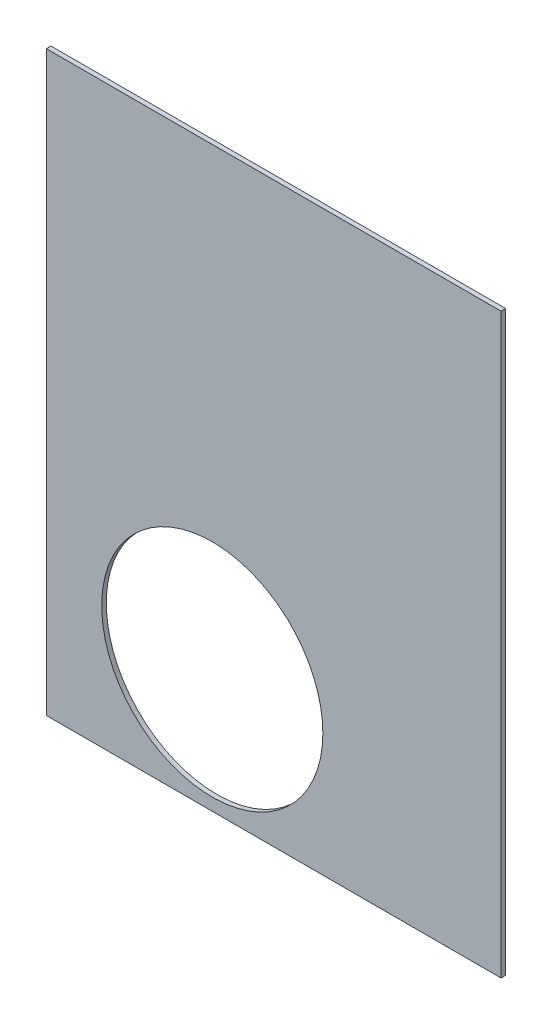
ISO-10303-21;
HEADER;
FILE_DESCRIPTION(('STEP AP214'),'2;1');
FILE_NAME('part.step','',(''),(''),'','','');
FILE_SCHEMA(('AUTOMOTIVE_DESIGN { 1 0 10303 214 1 1 1 1 }'));
ENDSEC;
DATA;
#1=APPLICATION_CONTEXT('core data for automotive mechanical design processes');
#2=APPLICATION_PROTOCOL_DEFINITION('international standard','automotive_design',2000,#1);
#3=PRODUCT_CONTEXT('',#1,'mechanical');
#4=PRODUCT('Part','Part','',(#3));
#5=PRODUCT_RELATED_PRODUCT_CATEGORY('part','',(#4));
#6=PRODUCT_DEFINITION_FORMATION('','',#4);
#7=PRODUCT_DEFINITION_CONTEXT('part definition',#1,'design');
#8=PRODUCT_DEFINITION('design','',#6,#7);
#9=PRODUCT_DEFINITION_SHAPE('','',#8);
#10=(LENGTH_UNIT() NAMED_UNIT(*) SI_UNIT(.MILLI.,.METRE.));
#11=(NAMED_UNIT(*) PLANE_ANGLE_UNIT() SI_UNIT($,.RADIAN.));
#12=(NAMED_UNIT(*) SI_UNIT($,.STERADIAN.) SOLID_ANGLE_UNIT());
#13=UNCERTAINTY_MEASURE_WITH_UNIT(LENGTH_MEASURE(1.E-05),#10,'distance_accuracy_value','');
#14=(GEOMETRIC_REPRESENTATION_CONTEXT(3) GLOBAL_UNCERTAINTY_ASSIGNED_CONTEXT((#13)) GLOBAL_UNIT_ASSIGNED_CONTEXT((#10,
#11,#12)) REPRESENTATION_CONTEXT('',''));
#15=CARTESIAN_POINT('',(0.,0.,0.));
#16=DIRECTION('',(0.,0.,1.));
#17=DIRECTION('',(1.,0.,0.));
#18=AXIS2_PLACEMENT_3D('',#15,#16,#17);
#19=CARTESIAN_POINT('',(36.9999999999999,5.50000000000002,0.75));
#20=DIRECTION('',(0.,1.,0.));
#21=DIRECTION('',(0.,0.,1.));
#22=AXIS2_PLACEMENT_3D('',#19,#20,#21);
#23=PLANE('',#22);
#24=DIRECTION('',(1.,0.,0.));
#25=VECTOR('',#24,1.);
#26=CARTESIAN_POINT('',(36.9999999999999,5.50000000000002,0.));
#27=LINE('',#26,#25);
#28=CARTESIAN_POINT('',(-37.,5.50000000000002,0.));
#29=VERTEX_POINT('',#28);
#30=CARTESIAN_POINT('',(36.9999999999999,5.50000000000002,0.));
#31=VERTEX_POINT('',#30);
#32=EDGE_CURVE('E96',#29,#31,#27,.T.);
#33=ORIENTED_EDGE('',*,*,#32,.T.);
#34=DIRECTION('',(0.,0.,-1.));
#35=VECTOR('',#34,1.);
#36=CARTESIAN_POINT('',(36.9999999999999,5.50000000000002,0.75));
#37=LINE('',#36,#35);
#38=CARTESIAN_POINT('',(36.9999999999999,5.50000000000002,0.75));
#39=VERTEX_POINT('',#38);
#40=EDGE_CURVE('E11',#39,#31,#37,.T.);
#41=ORIENTED_EDGE('',*,*,#40,.F.);
#42=DIRECTION('',(1.,0.,0.));
#43=VECTOR('',#42,1.);
#44=CARTESIAN_POINT('',(36.9999999999999,5.50000000000002,0.75));
#45=LINE('',#44,#43);
#46=CARTESIAN_POINT('',(-37.,5.50000000000002,0.75));
#47=VERTEX_POINT('',#46);
#48=EDGE_CURVE('E84',#47,#39,#45,.T.);
#49=ORIENTED_EDGE('',*,*,#48,.F.);
#50=DIRECTION('',(0.,0.,-1.));
#51=VECTOR('',#50,1.);
#52=CARTESIAN_POINT('',(-37.,5.50000000000002,0.75));
#53=LINE('',#52,#51);
#54=EDGE_CURVE('E92',#47,#29,#53,.T.);
#55=ORIENTED_EDGE('',*,*,#54,.T.);
#56=EDGE_LOOP('',(#33,#41,#49,#55));
#57=FACE_BOUND('',#56,.T.);
#58=ADVANCED_FACE('F33',(#57),#23,.F.);
#59=CARTESIAN_POINT('',(36.9999999999999,99.5,0.75));
#60=DIRECTION('',(-1.,0.,0.));
#61=DIRECTION('',(0.,0.,1.));
#62=AXIS2_PLACEMENT_3D('',#59,#60,#61);
#63=PLANE('',#62);
#64=DIRECTION('',(0.,1.,0.));
#65=VECTOR('',#64,1.);
#66=CARTESIAN_POINT('',(36.9999999999999,99.5,0.));
#67=LINE('',#66,#65);
#68=CARTESIAN_POINT('',(36.9999999999999,99.5,0.));
#69=VERTEX_POINT('',#68);
#70=EDGE_CURVE('E88',#31,#69,#67,.T.);
#71=ORIENTED_EDGE('',*,*,#70,.T.);
#72=DIRECTION('',(0.,0.,-1.));
#73=VECTOR('',#72,1.);
#74=CARTESIAN_POINT('',(36.9999999999999,99.5,0.75));
#75=LINE('',#74,#73);
#76=CARTESIAN_POINT('',(36.9999999999999,99.5,0.75));
#77=VERTEX_POINT('',#76);
#78=EDGE_CURVE('E41',#77,#69,#75,.T.);
#79=ORIENTED_EDGE('',*,*,#78,.F.);
#80=DIRECTION('',(0.,1.,0.));
#81=VECTOR('',#80,1.);
#82=CARTESIAN_POINT('',(36.9999999999999,99.5,0.75));
#83=LINE('',#82,#81);
#84=EDGE_CURVE('E79',#39,#77,#83,.T.);
#85=ORIENTED_EDGE('',*,*,#84,.F.);
#86=ORIENTED_EDGE('',*,*,#40,.T.);
#87=EDGE_LOOP('',(#71,#79,#85,#86));
#88=FACE_BOUND('',#87,.T.);
#89=ADVANCED_FACE('F87',(#88),#63,.F.);
#90=CARTESIAN_POINT('',(-37.,99.5,0.75));
#91=DIRECTION('',(0.,-1.,0.));
#92=DIRECTION('',(0.,0.,-1.));
#93=AXIS2_PLACEMENT_3D('',#90,#91,#92);
#94=PLANE('',#93);
#95=DIRECTION('',(-1.,0.,0.));
#96=VECTOR('',#95,1.);
#97=CARTESIAN_POINT('',(-37.,99.5,0.));
#98=LINE('',#97,#96);
#99=CARTESIAN_POINT('',(-37.,99.5,0.));
#100=VERTEX_POINT('',#99);
#101=EDGE_CURVE('E66',#69,#100,#98,.T.);
#102=ORIENTED_EDGE('',*,*,#101,.T.);
#103=DIRECTION('',(0.,0.,-1.));
#104=VECTOR('',#103,1.);
#105=CARTESIAN_POINT('',(-37.,99.5,0.75));
#106=LINE('',#105,#104);
#107=CARTESIAN_POINT('',(-37.,99.5,0.75));
#108=VERTEX_POINT('',#107);
#109=EDGE_CURVE('E89',#108,#100,#106,.T.);
#110=ORIENTED_EDGE('',*,*,#109,.F.);
#111=DIRECTION('',(-1.,0.,0.));
#112=VECTOR('',#111,1.);
#113=CARTESIAN_POINT('',(-37.,99.5,0.75));
#114=LINE('',#113,#112);
#115=EDGE_CURVE('E82',#77,#108,#114,.T.);
#116=ORIENTED_EDGE('',*,*,#115,.F.);
#117=ORIENTED_EDGE('',*,*,#78,.T.);
#118=EDGE_LOOP('',(#102,#110,#116,#117));
#119=FACE_BOUND('',#118,.T.);
#120=ADVANCED_FACE('F90',(#119),#94,.F.);
#121=CARTESIAN_POINT('',(-37.,5.50000000000002,0.75));
#122=DIRECTION('',(1.,0.,0.));
#123=DIRECTION('',(0.,0.,-1.));
#124=AXIS2_PLACEMENT_3D('',#121,#122,#123);
#125=PLANE('',#124);
#126=DIRECTION('',(0.,-1.,0.));
#127=VECTOR('',#126,1.);
#128=CARTESIAN_POINT('',(-37.,5.50000000000002,0.));
#129=LINE('',#128,#127);
#130=EDGE_CURVE('E72',#100,#29,#129,.T.);
#131=ORIENTED_EDGE('',*,*,#130,.T.);
#132=ORIENTED_EDGE('',*,*,#54,.F.);
#133=DIRECTION('',(0.,-1.,0.));
#134=VECTOR('',#133,1.);
#135=CARTESIAN_POINT('',(-37.,5.50000000000002,0.75));
#136=LINE('',#135,#134);
#137=EDGE_CURVE('E49',#108,#47,#136,.T.);
#138=ORIENTED_EDGE('',*,*,#137,.F.);
#139=ORIENTED_EDGE('',*,*,#109,.T.);
#140=EDGE_LOOP('',(#131,#132,#138,#139));
#141=FACE_BOUND('',#140,.T.);
#142=ADVANCED_FACE('F104',(#141),#125,.F.);
#143=CARTESIAN_POINT('',(0.,0.,0.75));
#144=DIRECTION('',(0.,0.,-1.));
#145=DIRECTION('',(-1.,0.,0.));
#146=AXIS2_PLACEMENT_3D('',#143,#144,#145);
#147=PLANE('',#146);
#148=CARTESIAN_POINT('',(-9.99999999999999,25.5,0.75));
#149=DIRECTION('',(0.,0.,1.));
#150=DIRECTION('',(1.,0.,0.));
#151=AXIS2_PLACEMENT_3D('',#148,#149,#150);
#152=CIRCLE('',#151,18.);
#153=CARTESIAN_POINT('',(8.,25.5,0.75));
#154=VERTEX_POINT('',#153);
#155=EDGE_CURVE('E110',#154,#154,#152,.T.);
#156=ORIENTED_EDGE('',*,*,#155,.F.);
#157=EDGE_LOOP('',(#156));
#158=FACE_BOUND('',#157,.T.);
#159=ORIENTED_EDGE('',*,*,#48,.T.);
#160=ORIENTED_EDGE('',*,*,#84,.T.);
#161=ORIENTED_EDGE('',*,*,#115,.T.);
#162=ORIENTED_EDGE('',*,*,#137,.T.);
#163=EDGE_LOOP('',(#159,#160,#161,#162));
#164=FACE_BOUND('',#163,.T.);
#165=ADVANCED_FACE('F80',(#158,#164),#147,.F.);
#166=CARTESIAN_POINT('',(0.,0.,0.));
#167=DIRECTION('',(0.,0.,-1.));
#168=DIRECTION('',(-1.,0.,0.));
#169=AXIS2_PLACEMENT_3D('',#166,#167,#168);
#170=PLANE('',#169);
#171=CARTESIAN_POINT('',(-9.99999999999999,25.5,0.));
#172=DIRECTION('',(0.,0.,1.));
#173=DIRECTION('',(1.,0.,0.));
#174=AXIS2_PLACEMENT_3D('',#171,#172,#173);
#175=CIRCLE('',#174,18.);
#176=CARTESIAN_POINT('',(8.,25.5,0.));
#177=VERTEX_POINT('',#176);
#178=EDGE_CURVE('E99',#177,#177,#175,.T.);
#179=ORIENTED_EDGE('',*,*,#178,.T.);
#180=EDGE_LOOP('',(#179));
#181=FACE_BOUND('',#180,.T.);
#182=ORIENTED_EDGE('',*,*,#32,.F.);
#183=ORIENTED_EDGE('',*,*,#130,.F.);
#184=ORIENTED_EDGE('',*,*,#101,.F.);
#185=ORIENTED_EDGE('',*,*,#70,.F.);
#186=EDGE_LOOP('',(#182,#183,#184,#185));
#187=FACE_BOUND('',#186,.T.);
#188=ADVANCED_FACE('F107',(#181,#187),#170,.T.);
#189=CARTESIAN_POINT('',(-9.99999999999999,25.5,0.));
#190=DIRECTION('',(0.,0.,1.));
#191=DIRECTION('',(1.,0.,0.));
#192=AXIS2_PLACEMENT_3D('',#189,#190,#191);
#193=CYLINDRICAL_SURFACE('',#192,18.);
#194=ORIENTED_EDGE('',*,*,#178,.F.);
#195=EDGE_LOOP('',(#194));
#196=FACE_BOUND('',#195,.T.);
#197=ORIENTED_EDGE('',*,*,#155,.T.);
#198=EDGE_LOOP('',(#197));
#199=FACE_BOUND('',#198,.T.);
#200=ADVANCED_FACE('F117',(#196,#199),#193,.F.);
#201=CLOSED_SHELL('',(#58,#89,#120,#142,#165,#188,#200));
#202=MANIFOLD_SOLID_BREP('B2',#201);
#203=ADVANCED_BREP_SHAPE_REPRESENTATION('',(#18,#202),#14);
#204=SHAPE_DEFINITION_REPRESENTATION(#9,#203);
ENDSEC;
END-ISO-10303-21;
